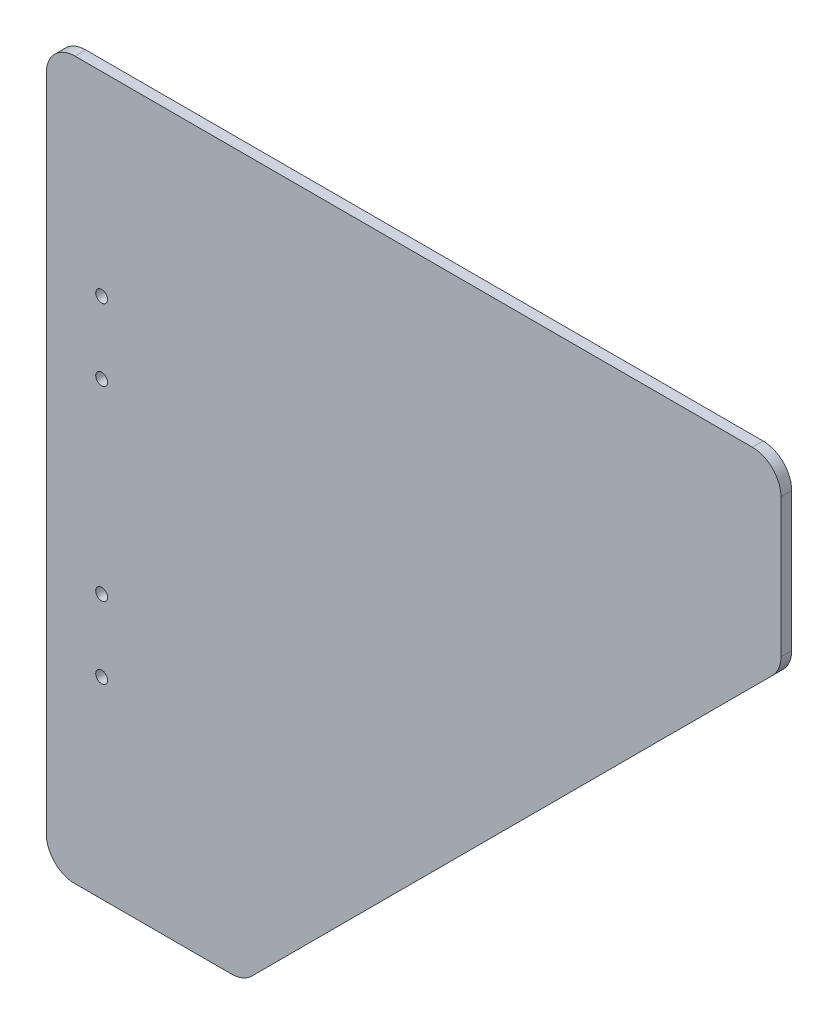
ISO-10303-21;
HEADER;
FILE_DESCRIPTION(('STEP AP214'),'2;1');
FILE_NAME('part.step','',(''),(''),'','','');
FILE_SCHEMA(('AUTOMOTIVE_DESIGN { 1 0 10303 214 1 1 1 1 }'));
ENDSEC;
DATA;
#1=APPLICATION_CONTEXT('core data for automotive mechanical design processes');
#2=APPLICATION_PROTOCOL_DEFINITION('international standard','automotive_design',2000,#1);
#3=PRODUCT_CONTEXT('',#1,'mechanical');
#4=PRODUCT('Part','Part','',(#3));
#5=PRODUCT_RELATED_PRODUCT_CATEGORY('part','',(#4));
#6=PRODUCT_DEFINITION_FORMATION('','',#4);
#7=PRODUCT_DEFINITION_CONTEXT('part definition',#1,'design');
#8=PRODUCT_DEFINITION('design','',#6,#7);
#9=PRODUCT_DEFINITION_SHAPE('','',#8);
#10=(LENGTH_UNIT() NAMED_UNIT(*) SI_UNIT(.MILLI.,.METRE.));
#11=(NAMED_UNIT(*) PLANE_ANGLE_UNIT() SI_UNIT($,.RADIAN.));
#12=(NAMED_UNIT(*) SI_UNIT($,.STERADIAN.) SOLID_ANGLE_UNIT());
#13=UNCERTAINTY_MEASURE_WITH_UNIT(LENGTH_MEASURE(1.E-05),#10,'distance_accuracy_value','');
#14=(GEOMETRIC_REPRESENTATION_CONTEXT(3) GLOBAL_UNCERTAINTY_ASSIGNED_CONTEXT((#13)) GLOBAL_UNIT_ASSIGNED_CONTEXT((#10,
#11,#12)) REPRESENTATION_CONTEXT('',''));
#15=CARTESIAN_POINT('',(0.,0.,0.));
#16=DIRECTION('',(0.,0.,1.));
#17=DIRECTION('',(1.,0.,0.));
#18=AXIS2_PLACEMENT_3D('',#15,#16,#17);
#19=CARTESIAN_POINT('',(51.6862915010169,8.00000000000001,3.));
#20=DIRECTION('',(0.,0.,-1.));
#21=DIRECTION('',(-1.,0.,0.));
#22=AXIS2_PLACEMENT_3D('',#19,#20,#21);
#23=CYLINDRICAL_SURFACE('',#22,8.00000000000001);
#24=CARTESIAN_POINT('',(51.6862915010169,8.00000000000001,0.));
#25=DIRECTION('',(0.,0.,1.));
#26=DIRECTION('',(-1.,0.,0.));
#27=AXIS2_PLACEMENT_3D('',#24,#25,#26);
#28=CIRCLE('',#27,8.00000000000001);
#29=CARTESIAN_POINT('',(51.6862915010169,0.,0.));
#30=VERTEX_POINT('',#29);
#31=CARTESIAN_POINT('',(57.3431457505093,2.34314575050765,0.));
#32=VERTEX_POINT('',#31);
#33=EDGE_CURVE('E145',#30,#32,#28,.T.);
#34=ORIENTED_EDGE('',*,*,#33,.T.);
#35=DIRECTION('',(0.,0.,-1.));
#36=VECTOR('',#35,1.);
#37=CARTESIAN_POINT('',(57.3431457505093,2.34314575050765,3.));
#38=LINE('',#37,#36);
#39=CARTESIAN_POINT('',(57.3431457505093,2.34314575050765,3.));
#40=VERTEX_POINT('',#39);
#41=EDGE_CURVE('E11',#40,#32,#38,.T.);
#42=ORIENTED_EDGE('',*,*,#41,.F.);
#43=CARTESIAN_POINT('',(51.6862915010169,8.00000000000001,3.));
#44=DIRECTION('',(0.,0.,1.));
#45=DIRECTION('',(-1.,0.,0.));
#46=AXIS2_PLACEMENT_3D('',#43,#44,#45);
#47=CIRCLE('',#46,8.00000000000001);
#48=CARTESIAN_POINT('',(51.6862915010169,0.,3.));
#49=VERTEX_POINT('',#48);
#50=EDGE_CURVE('E164',#49,#40,#47,.T.);
#51=ORIENTED_EDGE('',*,*,#50,.F.);
#52=DIRECTION('',(0.,0.,-1.));
#53=VECTOR('',#52,1.);
#54=CARTESIAN_POINT('',(51.6862915010169,0.,3.));
#55=LINE('',#54,#53);
#56=EDGE_CURVE('E141',#49,#30,#55,.T.);
#57=ORIENTED_EDGE('',*,*,#56,.T.);
#58=EDGE_LOOP('',(#34,#42,#51,#57));
#59=FACE_BOUND('',#58,.T.);
#60=ADVANCED_FACE('F36',(#59),#23,.T.);
#61=CARTESIAN_POINT('',(202.656854249492,147.656854249492,3.));
#62=DIRECTION('',(-0.707106781186552,0.707106781186543,0.));
#63=DIRECTION('',(-0.707106781186543,-0.707106781186552,0.));
#64=AXIS2_PLACEMENT_3D('',#61,#62,#63);
#65=PLANE('',#64);
#66=DIRECTION('',(0.707106781186543,0.707106781186552,0.));
#67=VECTOR('',#66,1.);
#68=CARTESIAN_POINT('',(202.656854249492,147.656854249492,0.));
#69=LINE('',#68,#67);
#70=CARTESIAN_POINT('',(202.656854249492,147.656854249492,0.));
#71=VERTEX_POINT('',#70);
#72=EDGE_CURVE('E148',#32,#71,#69,.T.);
#73=ORIENTED_EDGE('',*,*,#72,.T.);
#74=DIRECTION('',(0.,0.,-1.));
#75=VECTOR('',#74,1.);
#76=CARTESIAN_POINT('',(202.656854249492,147.656854249492,3.));
#77=LINE('',#76,#75);
#78=CARTESIAN_POINT('',(202.656854249492,147.656854249492,3.));
#79=VERTEX_POINT('',#78);
#80=EDGE_CURVE('E45',#79,#71,#77,.T.);
#81=ORIENTED_EDGE('',*,*,#80,.F.);
#82=DIRECTION('',(0.707106781186543,0.707106781186552,0.));
#83=VECTOR('',#82,1.);
#84=CARTESIAN_POINT('',(202.656854249492,147.656854249492,3.));
#85=LINE('',#84,#83);
#86=EDGE_CURVE('E102',#40,#79,#85,.T.);
#87=ORIENTED_EDGE('',*,*,#86,.F.);
#88=ORIENTED_EDGE('',*,*,#41,.T.);
#89=EDGE_LOOP('',(#73,#81,#87,#88));
#90=FACE_BOUND('',#89,.T.);
#91=ADVANCED_FACE('F264',(#90),#65,.F.);
#92=CARTESIAN_POINT('',(197.,153.313708498985,3.));
#93=DIRECTION('',(0.,0.,-1.));
#94=DIRECTION('',(-1.,0.,0.));
#95=AXIS2_PLACEMENT_3D('',#92,#93,#94);
#96=CYLINDRICAL_SURFACE('',#95,8.);
#97=CARTESIAN_POINT('',(197.,153.313708498985,0.));
#98=DIRECTION('',(0.,0.,1.));
#99=DIRECTION('',(-1.,0.,0.));
#100=AXIS2_PLACEMENT_3D('',#97,#98,#99);
#101=CIRCLE('',#100,8.);
#102=CARTESIAN_POINT('',(205.,153.313708498985,0.));
#103=VERTEX_POINT('',#102);
#104=EDGE_CURVE('E151',#71,#103,#101,.T.);
#105=ORIENTED_EDGE('',*,*,#104,.T.);
#106=DIRECTION('',(0.,0.,-1.));
#107=VECTOR('',#106,1.);
#108=CARTESIAN_POINT('',(205.,153.313708498985,3.));
#109=LINE('',#108,#107);
#110=CARTESIAN_POINT('',(205.,153.313708498985,3.));
#111=VERTEX_POINT('',#110);
#112=EDGE_CURVE('E177',#111,#103,#109,.T.);
#113=ORIENTED_EDGE('',*,*,#112,.F.);
#114=CARTESIAN_POINT('',(197.,153.313708498985,3.));
#115=DIRECTION('',(0.,0.,1.));
#116=DIRECTION('',(-1.,0.,0.));
#117=AXIS2_PLACEMENT_3D('',#114,#115,#116);
#118=CIRCLE('',#117,8.);
#119=EDGE_CURVE('E186',#79,#111,#118,.T.);
#120=ORIENTED_EDGE('',*,*,#119,.F.);
#121=ORIENTED_EDGE('',*,*,#80,.T.);
#122=EDGE_LOOP('',(#105,#113,#120,#121));
#123=FACE_BOUND('',#122,.T.);
#124=ADVANCED_FACE('F184',(#123),#96,.T.);
#125=CARTESIAN_POINT('',(205.,192.,3.));
#126=DIRECTION('',(-1.,0.,0.));
#127=DIRECTION('',(0.,0.,1.));
#128=AXIS2_PLACEMENT_3D('',#125,#126,#127);
#129=PLANE('',#128);
#130=DIRECTION('',(0.,1.,0.));
#131=VECTOR('',#130,1.);
#132=CARTESIAN_POINT('',(205.,192.,0.));
#133=LINE('',#132,#131);
#134=CARTESIAN_POINT('',(205.,192.,0.));
#135=VERTEX_POINT('',#134);
#136=EDGE_CURVE('E153',#103,#135,#133,.T.);
#137=ORIENTED_EDGE('',*,*,#136,.T.);
#138=DIRECTION('',(0.,0.,-1.));
#139=VECTOR('',#138,1.);
#140=CARTESIAN_POINT('',(205.,192.,3.));
#141=LINE('',#140,#139);
#142=CARTESIAN_POINT('',(205.,192.,3.));
#143=VERTEX_POINT('',#142);
#144=EDGE_CURVE('E174',#143,#135,#141,.T.);
#145=ORIENTED_EDGE('',*,*,#144,.F.);
#146=DIRECTION('',(0.,1.,0.));
#147=VECTOR('',#146,1.);
#148=CARTESIAN_POINT('',(205.,192.,3.));
#149=LINE('',#148,#147);
#150=EDGE_CURVE('E204',#111,#143,#149,.T.);
#151=ORIENTED_EDGE('',*,*,#150,.F.);
#152=ORIENTED_EDGE('',*,*,#112,.T.);
#153=EDGE_LOOP('',(#137,#145,#151,#152));
#154=FACE_BOUND('',#153,.T.);
#155=ADVANCED_FACE('F195',(#154),#129,.F.);
#156=CARTESIAN_POINT('',(197.,192.,3.));
#157=DIRECTION('',(0.,0.,-1.));
#158=DIRECTION('',(-1.,0.,0.));
#159=AXIS2_PLACEMENT_3D('',#156,#157,#158);
#160=CYLINDRICAL_SURFACE('',#159,8.00000000000001);
#161=CARTESIAN_POINT('',(197.,192.,0.));
#162=DIRECTION('',(0.,0.,1.));
#163=DIRECTION('',(-1.,0.,0.));
#164=AXIS2_PLACEMENT_3D('',#161,#162,#163);
#165=CIRCLE('',#164,8.00000000000001);
#166=CARTESIAN_POINT('',(197.,200.,0.));
#167=VERTEX_POINT('',#166);
#168=EDGE_CURVE('E155',#135,#167,#165,.T.);
#169=ORIENTED_EDGE('',*,*,#168,.T.);
#170=DIRECTION('',(0.,0.,-1.));
#171=VECTOR('',#170,1.);
#172=CARTESIAN_POINT('',(197.,200.,3.));
#173=LINE('',#172,#171);
#174=CARTESIAN_POINT('',(197.,200.,3.));
#175=VERTEX_POINT('',#174);
#176=EDGE_CURVE('E171',#175,#167,#173,.T.);
#177=ORIENTED_EDGE('',*,*,#176,.F.);
#178=CARTESIAN_POINT('',(197.,192.,3.));
#179=DIRECTION('',(0.,0.,1.));
#180=DIRECTION('',(-1.,0.,0.));
#181=AXIS2_PLACEMENT_3D('',#178,#179,#180);
#182=CIRCLE('',#181,8.00000000000001);
#183=EDGE_CURVE('E201',#143,#175,#182,.T.);
#184=ORIENTED_EDGE('',*,*,#183,.F.);
#185=ORIENTED_EDGE('',*,*,#144,.T.);
#186=EDGE_LOOP('',(#169,#177,#184,#185));
#187=FACE_BOUND('',#186,.T.);
#188=ADVANCED_FACE('F199',(#187),#160,.T.);
#189=CARTESIAN_POINT('',(8.,200.,3.));
#190=DIRECTION('',(0.,-1.,0.));
#191=DIRECTION('',(0.,0.,-1.));
#192=AXIS2_PLACEMENT_3D('',#189,#190,#191);
#193=PLANE('',#192);
#194=DIRECTION('',(-1.,0.,0.));
#195=VECTOR('',#194,1.);
#196=CARTESIAN_POINT('',(8.,200.,0.));
#197=LINE('',#196,#195);
#198=CARTESIAN_POINT('',(8.,200.,0.));
#199=VERTEX_POINT('',#198);
#200=EDGE_CURVE('E157',#167,#199,#197,.T.);
#201=ORIENTED_EDGE('',*,*,#200,.T.);
#202=DIRECTION('',(0.,0.,-1.));
#203=VECTOR('',#202,1.);
#204=CARTESIAN_POINT('',(8.,200.,3.));
#205=LINE('',#204,#203);
#206=CARTESIAN_POINT('',(8.,200.,3.));
#207=VERTEX_POINT('',#206);
#208=EDGE_CURVE('E168',#207,#199,#205,.T.);
#209=ORIENTED_EDGE('',*,*,#208,.F.);
#210=DIRECTION('',(-1.,0.,0.));
#211=VECTOR('',#210,1.);
#212=CARTESIAN_POINT('',(8.,200.,3.));
#213=LINE('',#212,#211);
#214=EDGE_CURVE('E203',#175,#207,#213,.T.);
#215=ORIENTED_EDGE('',*,*,#214,.F.);
#216=ORIENTED_EDGE('',*,*,#176,.T.);
#217=EDGE_LOOP('',(#201,#209,#215,#216));
#218=FACE_BOUND('',#217,.T.);
#219=ADVANCED_FACE('F276',(#218),#193,.F.);
#220=CARTESIAN_POINT('',(8.,192.,3.));
#221=DIRECTION('',(0.,0.,-1.));
#222=DIRECTION('',(-1.,0.,0.));
#223=AXIS2_PLACEMENT_3D('',#220,#221,#222);
#224=CYLINDRICAL_SURFACE('',#223,8.);
#225=CARTESIAN_POINT('',(8.,192.,0.));
#226=DIRECTION('',(0.,0.,1.));
#227=DIRECTION('',(1.,0.,0.));
#228=AXIS2_PLACEMENT_3D('',#225,#226,#227);
#229=CIRCLE('',#228,8.);
#230=CARTESIAN_POINT('',(0.,192.,0.));
#231=VERTEX_POINT('',#230);
#232=EDGE_CURVE('E159',#199,#231,#229,.T.);
#233=ORIENTED_EDGE('',*,*,#232,.T.);
#234=DIRECTION('',(0.,0.,-1.));
#235=VECTOR('',#234,1.);
#236=CARTESIAN_POINT('',(0.,192.,3.));
#237=LINE('',#236,#235);
#238=CARTESIAN_POINT('',(0.,192.,3.));
#239=VERTEX_POINT('',#238);
#240=EDGE_CURVE('E136',#239,#231,#237,.T.);
#241=ORIENTED_EDGE('',*,*,#240,.F.);
#242=CARTESIAN_POINT('',(8.,192.,3.));
#243=DIRECTION('',(0.,0.,1.));
#244=DIRECTION('',(1.,0.,0.));
#245=AXIS2_PLACEMENT_3D('',#242,#243,#244);
#246=CIRCLE('',#245,8.);
#247=EDGE_CURVE('E127',#207,#239,#246,.T.);
#248=ORIENTED_EDGE('',*,*,#247,.F.);
#249=ORIENTED_EDGE('',*,*,#208,.T.);
#250=EDGE_LOOP('',(#233,#241,#248,#249));
#251=FACE_BOUND('',#250,.T.);
#252=ADVANCED_FACE('F273',(#251),#224,.T.);
#253=CARTESIAN_POINT('',(0.,7.99999999999999,3.));
#254=DIRECTION('',(1.,0.,0.));
#255=DIRECTION('',(0.,1.,0.));
#256=AXIS2_PLACEMENT_3D('',#253,#254,#255);
#257=PLANE('',#256);
#258=DIRECTION('',(0.,-1.,0.));
#259=VECTOR('',#258,1.);
#260=CARTESIAN_POINT('',(0.,7.99999999999999,0.));
#261=LINE('',#260,#259);
#262=CARTESIAN_POINT('',(0.,7.99999999999999,0.));
#263=VERTEX_POINT('',#262);
#264=EDGE_CURVE('E135',#231,#263,#261,.T.);
#265=ORIENTED_EDGE('',*,*,#264,.T.);
#266=DIRECTION('',(0.,0.,-1.));
#267=VECTOR('',#266,1.);
#268=CARTESIAN_POINT('',(0.,7.99999999999999,3.));
#269=LINE('',#268,#267);
#270=CARTESIAN_POINT('',(0.,7.99999999999999,3.));
#271=VERTEX_POINT('',#270);
#272=EDGE_CURVE('E132',#271,#263,#269,.T.);
#273=ORIENTED_EDGE('',*,*,#272,.F.);
#274=DIRECTION('',(0.,-1.,0.));
#275=VECTOR('',#274,1.);
#276=CARTESIAN_POINT('',(0.,7.99999999999999,3.));
#277=LINE('',#276,#275);
#278=EDGE_CURVE('E121',#239,#271,#277,.T.);
#279=ORIENTED_EDGE('',*,*,#278,.F.);
#280=ORIENTED_EDGE('',*,*,#240,.T.);
#281=EDGE_LOOP('',(#265,#273,#279,#280));
#282=FACE_BOUND('',#281,.T.);
#283=ADVANCED_FACE('F133',(#282),#257,.F.);
#284=CARTESIAN_POINT('',(8.,7.99999999999999,3.));
#285=DIRECTION('',(0.,0.,-1.));
#286=DIRECTION('',(-1.,0.,0.));
#287=AXIS2_PLACEMENT_3D('',#284,#285,#286);
#288=CYLINDRICAL_SURFACE('',#287,8.);
#289=CARTESIAN_POINT('',(8.,7.99999999999999,0.));
#290=DIRECTION('',(0.,0.,1.));
#291=DIRECTION('',(1.,0.,0.));
#292=AXIS2_PLACEMENT_3D('',#289,#290,#291);
#293=CIRCLE('',#292,8.);
#294=CARTESIAN_POINT('',(8.,0.,0.));
#295=VERTEX_POINT('',#294);
#296=EDGE_CURVE('E88',#263,#295,#293,.T.);
#297=ORIENTED_EDGE('',*,*,#296,.T.);
#298=DIRECTION('',(0.,0.,-1.));
#299=VECTOR('',#298,1.);
#300=CARTESIAN_POINT('',(8.,0.,3.));
#301=LINE('',#300,#299);
#302=CARTESIAN_POINT('',(8.,0.,3.));
#303=VERTEX_POINT('',#302);
#304=EDGE_CURVE('E137',#303,#295,#301,.T.);
#305=ORIENTED_EDGE('',*,*,#304,.F.);
#306=CARTESIAN_POINT('',(8.,7.99999999999999,3.));
#307=DIRECTION('',(0.,0.,1.));
#308=DIRECTION('',(1.,0.,0.));
#309=AXIS2_PLACEMENT_3D('',#306,#307,#308);
#310=CIRCLE('',#309,8.);
#311=EDGE_CURVE('E125',#271,#303,#310,.T.);
#312=ORIENTED_EDGE('',*,*,#311,.F.);
#313=ORIENTED_EDGE('',*,*,#272,.T.);
#314=EDGE_LOOP('',(#297,#305,#312,#313));
#315=FACE_BOUND('',#314,.T.);
#316=ADVANCED_FACE('F139',(#315),#288,.T.);
#317=CARTESIAN_POINT('',(51.6862915010169,0.,3.));
#318=DIRECTION('',(0.,1.,0.));
#319=DIRECTION('',(-1.,0.,0.));
#320=AXIS2_PLACEMENT_3D('',#317,#318,#319);
#321=PLANE('',#320);
#322=DIRECTION('',(1.,0.,0.));
#323=VECTOR('',#322,1.);
#324=CARTESIAN_POINT('',(51.6862915010169,0.,0.));
#325=LINE('',#324,#323);
#326=EDGE_CURVE('E94',#295,#30,#325,.T.);
#327=ORIENTED_EDGE('',*,*,#326,.T.);
#328=ORIENTED_EDGE('',*,*,#56,.F.);
#329=DIRECTION('',(1.,0.,0.));
#330=VECTOR('',#329,1.);
#331=CARTESIAN_POINT('',(51.6862915010169,0.,3.));
#332=LINE('',#331,#330);
#333=EDGE_CURVE('E53',#303,#49,#332,.T.);
#334=ORIENTED_EDGE('',*,*,#333,.F.);
#335=ORIENTED_EDGE('',*,*,#304,.T.);
#336=EDGE_LOOP('',(#327,#328,#334,#335));
#337=FACE_BOUND('',#336,.T.);
#338=ADVANCED_FACE('F255',(#337),#321,.F.);
#339=CARTESIAN_POINT('',(51.6862915010169,8.00000000000001,3.));
#340=DIRECTION('',(0.,0.,-1.));
#341=DIRECTION('',(-1.,0.,0.));
#342=AXIS2_PLACEMENT_3D('',#339,#340,#341);
#343=PLANE('',#342);
#344=CARTESIAN_POINT('',(15.442695020107,145.7,3.));
#345=DIRECTION('',(0.,0.,1.));
#346=DIRECTION('',(1.,0.,0.));
#347=AXIS2_PLACEMENT_3D('',#344,#345,#346);
#348=CIRCLE('',#347,1.64999999999999);
#349=CARTESIAN_POINT('',(17.092695020107,145.7,3.));
#350=VERTEX_POINT('',#349);
#351=EDGE_CURVE('E229',#350,#350,#348,.T.);
#352=ORIENTED_EDGE('',*,*,#351,.F.);
#353=EDGE_LOOP('',(#352));
#354=FACE_BOUND('',#353,.T.);
#355=CARTESIAN_POINT('',(15.4426950201071,125.7,3.));
#356=DIRECTION('',(0.,0.,1.));
#357=DIRECTION('',(1.,0.,0.));
#358=AXIS2_PLACEMENT_3D('',#355,#356,#357);
#359=CIRCLE('',#358,1.64999999999999);
#360=CARTESIAN_POINT('',(17.0926950201071,125.7,3.));
#361=VERTEX_POINT('',#360);
#362=EDGE_CURVE('E226',#361,#361,#359,.T.);
#363=ORIENTED_EDGE('',*,*,#362,.F.);
#364=EDGE_LOOP('',(#363));
#365=FACE_BOUND('',#364,.T.);
#366=CARTESIAN_POINT('',(15.4426950201071,73.6999999999999,3.));
#367=DIRECTION('',(0.,0.,1.));
#368=DIRECTION('',(1.,0.,0.));
#369=AXIS2_PLACEMENT_3D('',#366,#367,#368);
#370=CIRCLE('',#369,1.64999999999999);
#371=CARTESIAN_POINT('',(17.0926950201071,73.6999999999999,3.));
#372=VERTEX_POINT('',#371);
#373=EDGE_CURVE('E220',#372,#372,#370,.T.);
#374=ORIENTED_EDGE('',*,*,#373,.F.);
#375=EDGE_LOOP('',(#374));
#376=FACE_BOUND('',#375,.T.);
#377=CARTESIAN_POINT('',(15.4426950201071,53.6999999999999,3.));
#378=DIRECTION('',(0.,0.,1.));
#379=DIRECTION('',(1.,0.,0.));
#380=AXIS2_PLACEMENT_3D('',#377,#378,#379);
#381=CIRCLE('',#380,1.64999999999999);
#382=CARTESIAN_POINT('',(17.0926950201071,53.6999999999999,3.));
#383=VERTEX_POINT('',#382);
#384=EDGE_CURVE('E214',#383,#383,#381,.T.);
#385=ORIENTED_EDGE('',*,*,#384,.F.);
#386=EDGE_LOOP('',(#385));
#387=FACE_BOUND('',#386,.T.);
#388=ORIENTED_EDGE('',*,*,#50,.T.);
#389=ORIENTED_EDGE('',*,*,#86,.T.);
#390=ORIENTED_EDGE('',*,*,#119,.T.);
#391=ORIENTED_EDGE('',*,*,#150,.T.);
#392=ORIENTED_EDGE('',*,*,#183,.T.);
#393=ORIENTED_EDGE('',*,*,#214,.T.);
#394=ORIENTED_EDGE('',*,*,#247,.T.);
#395=ORIENTED_EDGE('',*,*,#278,.T.);
#396=ORIENTED_EDGE('',*,*,#311,.T.);
#397=ORIENTED_EDGE('',*,*,#333,.T.);
#398=EDGE_LOOP('',(#388,#389,#390,#391,#392,#393,#394,#395,#396,#397));
#399=FACE_BOUND('',#398,.T.);
#400=ADVANCED_FACE('F123',(#354,#365,#376,#387,#399),#343,.F.);
#401=CARTESIAN_POINT('',(51.6862915010169,8.00000000000001,0.));
#402=DIRECTION('',(0.,0.,-1.));
#403=DIRECTION('',(-1.,0.,0.));
#404=AXIS2_PLACEMENT_3D('',#401,#402,#403);
#405=PLANE('',#404);
#406=CARTESIAN_POINT('',(15.442695020107,145.7,0.));
#407=DIRECTION('',(0.,0.,-1.));
#408=DIRECTION('',(-1.,0.,0.));
#409=AXIS2_PLACEMENT_3D('',#406,#407,#408);
#410=CIRCLE('',#409,1.64999999999999);
#411=CARTESIAN_POINT('',(13.7926950201071,145.7,0.));
#412=VERTEX_POINT('',#411);
#413=EDGE_CURVE('E39',#412,#412,#410,.T.);
#414=ORIENTED_EDGE('',*,*,#413,.F.);
#415=EDGE_LOOP('',(#414));
#416=FACE_BOUND('',#415,.T.);
#417=CARTESIAN_POINT('',(15.4426950201071,125.7,0.));
#418=DIRECTION('',(0.,0.,-1.));
#419=DIRECTION('',(-1.,0.,0.));
#420=AXIS2_PLACEMENT_3D('',#417,#418,#419);
#421=CIRCLE('',#420,1.64999999999999);
#422=CARTESIAN_POINT('',(13.7926950201071,125.7,0.));
#423=VERTEX_POINT('',#422);
#424=EDGE_CURVE('E223',#423,#423,#421,.T.);
#425=ORIENTED_EDGE('',*,*,#424,.F.);
#426=EDGE_LOOP('',(#425));
#427=FACE_BOUND('',#426,.T.);
#428=CARTESIAN_POINT('',(15.4426950201071,73.6999999999999,0.));
#429=DIRECTION('',(0.,0.,-1.));
#430=DIRECTION('',(-1.,0.,0.));
#431=AXIS2_PLACEMENT_3D('',#428,#429,#430);
#432=CIRCLE('',#431,1.64999999999999);
#433=CARTESIAN_POINT('',(13.7926950201071,73.6999999999999,0.));
#434=VERTEX_POINT('',#433);
#435=EDGE_CURVE('E217',#434,#434,#432,.T.);
#436=ORIENTED_EDGE('',*,*,#435,.F.);
#437=EDGE_LOOP('',(#436));
#438=FACE_BOUND('',#437,.T.);
#439=CARTESIAN_POINT('',(15.4426950201071,53.6999999999999,0.));
#440=DIRECTION('',(0.,0.,-1.));
#441=DIRECTION('',(-1.,0.,0.));
#442=AXIS2_PLACEMENT_3D('',#439,#440,#441);
#443=CIRCLE('',#442,1.64999999999999);
#444=CARTESIAN_POINT('',(13.7926950201071,53.6999999999999,0.));
#445=VERTEX_POINT('',#444);
#446=EDGE_CURVE('E149',#445,#445,#443,.T.);
#447=ORIENTED_EDGE('',*,*,#446,.F.);
#448=EDGE_LOOP('',(#447));
#449=FACE_BOUND('',#448,.T.);
#450=ORIENTED_EDGE('',*,*,#33,.F.);
#451=ORIENTED_EDGE('',*,*,#326,.F.);
#452=ORIENTED_EDGE('',*,*,#296,.F.);
#453=ORIENTED_EDGE('',*,*,#264,.F.);
#454=ORIENTED_EDGE('',*,*,#232,.F.);
#455=ORIENTED_EDGE('',*,*,#200,.F.);
#456=ORIENTED_EDGE('',*,*,#168,.F.);
#457=ORIENTED_EDGE('',*,*,#136,.F.);
#458=ORIENTED_EDGE('',*,*,#104,.F.);
#459=ORIENTED_EDGE('',*,*,#72,.F.);
#460=EDGE_LOOP('',(#450,#451,#452,#453,#454,#455,#456,#457,#458,#459));
#461=FACE_BOUND('',#460,.T.);
#462=ADVANCED_FACE('F190',(#416,#427,#438,#449,#461),#405,.T.);
#463=CARTESIAN_POINT('',(15.4426950201071,53.6999999999999,3.));
#464=DIRECTION('',(0.,0.,1.));
#465=DIRECTION('',(1.,0.,0.));
#466=AXIS2_PLACEMENT_3D('',#463,#464,#465);
#467=CYLINDRICAL_SURFACE('',#466,1.64999999999999);
#468=ORIENTED_EDGE('',*,*,#446,.T.);
#469=EDGE_LOOP('',(#468));
#470=FACE_BOUND('',#469,.T.);
#471=ORIENTED_EDGE('',*,*,#384,.T.);
#472=EDGE_LOOP('',(#471));
#473=FACE_BOUND('',#472,.T.);
#474=ADVANCED_FACE('F240',(#470,#473),#467,.F.);
#475=CARTESIAN_POINT('',(15.4426950201071,73.6999999999999,3.));
#476=DIRECTION('',(0.,0.,1.));
#477=DIRECTION('',(1.,0.,0.));
#478=AXIS2_PLACEMENT_3D('',#475,#476,#477);
#479=CYLINDRICAL_SURFACE('',#478,1.64999999999999);
#480=ORIENTED_EDGE('',*,*,#435,.T.);
#481=EDGE_LOOP('',(#480));
#482=FACE_BOUND('',#481,.T.);
#483=ORIENTED_EDGE('',*,*,#373,.T.);
#484=EDGE_LOOP('',(#483));
#485=FACE_BOUND('',#484,.T.);
#486=ADVANCED_FACE('F250',(#482,#485),#479,.F.);
#487=CARTESIAN_POINT('',(15.4426950201071,125.7,3.));
#488=DIRECTION('',(0.,0.,1.));
#489=DIRECTION('',(1.,0.,0.));
#490=AXIS2_PLACEMENT_3D('',#487,#488,#489);
#491=CYLINDRICAL_SURFACE('',#490,1.64999999999999);
#492=ORIENTED_EDGE('',*,*,#424,.T.);
#493=EDGE_LOOP('',(#492));
#494=FACE_BOUND('',#493,.T.);
#495=ORIENTED_EDGE('',*,*,#362,.T.);
#496=EDGE_LOOP('',(#495));
#497=FACE_BOUND('',#496,.T.);
#498=ADVANCED_FACE('F360',(#494,#497),#491,.F.);
#499=CARTESIAN_POINT('',(15.442695020107,145.7,3.));
#500=DIRECTION('',(0.,0.,1.));
#501=DIRECTION('',(1.,0.,0.));
#502=AXIS2_PLACEMENT_3D('',#499,#500,#501);
#503=CYLINDRICAL_SURFACE('',#502,1.64999999999999);
#504=ORIENTED_EDGE('',*,*,#413,.T.);
#505=EDGE_LOOP('',(#504));
#506=FACE_BOUND('',#505,.T.);
#507=ORIENTED_EDGE('',*,*,#351,.T.);
#508=EDGE_LOOP('',(#507));
#509=FACE_BOUND('',#508,.T.);
#510=ADVANCED_FACE('F236',(#506,#509),#503,.F.);
#511=CLOSED_SHELL('',(#60,#91,#124,#155,#188,#219,#252,#283,#316,#338,#400,#462,#474,#486,#498,#510));
#512=MANIFOLD_SOLID_BREP('B2',#511);
#513=ADVANCED_BREP_SHAPE_REPRESENTATION('',(#18,#512),#14);
#514=SHAPE_DEFINITION_REPRESENTATION(#9,#513);
ENDSEC;
END-ISO-10303-21;
